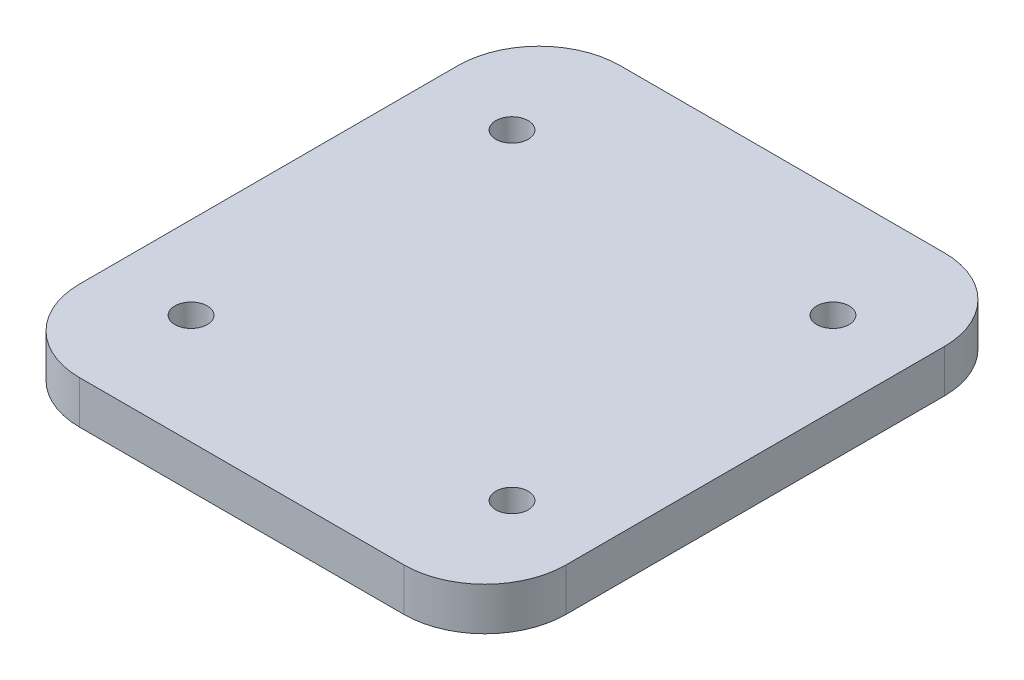
ISO-10303-21;
HEADER;
FILE_DESCRIPTION(('STEP AP214'),'2;1');
FILE_NAME('part.step','',(''),(''),'','','');
FILE_SCHEMA(('AUTOMOTIVE_DESIGN { 1 0 10303 214 1 1 1 1 }'));
ENDSEC;
DATA;
#1=APPLICATION_CONTEXT('core data for automotive mechanical design processes');
#2=APPLICATION_PROTOCOL_DEFINITION('international standard','automotive_design',2000,#1);
#3=PRODUCT_CONTEXT('',#1,'mechanical');
#4=PRODUCT('Part','Part','',(#3));
#5=PRODUCT_RELATED_PRODUCT_CATEGORY('part','',(#4));
#6=PRODUCT_DEFINITION_FORMATION('','',#4);
#7=PRODUCT_DEFINITION_CONTEXT('part definition',#1,'design');
#8=PRODUCT_DEFINITION('design','',#6,#7);
#9=PRODUCT_DEFINITION_SHAPE('','',#8);
#10=(LENGTH_UNIT() NAMED_UNIT(*) SI_UNIT(.MILLI.,.METRE.));
#11=(NAMED_UNIT(*) PLANE_ANGLE_UNIT() SI_UNIT($,.RADIAN.));
#12=(NAMED_UNIT(*) SI_UNIT($,.STERADIAN.) SOLID_ANGLE_UNIT());
#13=UNCERTAINTY_MEASURE_WITH_UNIT(LENGTH_MEASURE(1.E-05),#10,'distance_accuracy_value','');
#14=(GEOMETRIC_REPRESENTATION_CONTEXT(3) GLOBAL_UNCERTAINTY_ASSIGNED_CONTEXT((#13)) GLOBAL_UNIT_ASSIGNED_CONTEXT((#10,
#11,#12)) REPRESENTATION_CONTEXT('',''));
#15=CARTESIAN_POINT('',(0.,0.,0.));
#16=DIRECTION('',(0.,0.,1.));
#17=DIRECTION('',(1.,0.,0.));
#18=AXIS2_PLACEMENT_3D('',#15,#16,#17);
#19=CARTESIAN_POINT('',(24.,6.35,-28.));
#20=DIRECTION('',(0.,-1.,0.));
#21=DIRECTION('',(0.,0.,-1.));
#22=AXIS2_PLACEMENT_3D('',#19,#20,#21);
#23=CYLINDRICAL_SURFACE('',#22,12.);
#24=CARTESIAN_POINT('',(24.,0.,-28.));
#25=DIRECTION('',(0.,1.,0.));
#26=DIRECTION('',(0.,0.,-1.));
#27=AXIS2_PLACEMENT_3D('',#24,#25,#26);
#28=CIRCLE('',#27,12.);
#29=CARTESIAN_POINT('',(36.,0.,-28.));
#30=VERTEX_POINT('',#29);
#31=CARTESIAN_POINT('',(24.,0.,-40.));
#32=VERTEX_POINT('',#31);
#33=EDGE_CURVE('E155',#30,#32,#28,.T.);
#34=ORIENTED_EDGE('',*,*,#33,.T.);
#35=DIRECTION('',(0.,-1.,0.));
#36=VECTOR('',#35,1.);
#37=CARTESIAN_POINT('',(24.,6.35,-40.));
#38=LINE('',#37,#36);
#39=CARTESIAN_POINT('',(24.,6.35,-40.));
#40=VERTEX_POINT('',#39);
#41=EDGE_CURVE('E11',#40,#32,#38,.T.);
#42=ORIENTED_EDGE('',*,*,#41,.F.);
#43=CARTESIAN_POINT('',(24.,6.35,-28.));
#44=DIRECTION('',(0.,1.,0.));
#45=DIRECTION('',(0.,0.,-1.));
#46=AXIS2_PLACEMENT_3D('',#43,#44,#45);
#47=CIRCLE('',#46,12.);
#48=CARTESIAN_POINT('',(36.,6.35,-28.));
#49=VERTEX_POINT('',#48);
#50=EDGE_CURVE('E171',#49,#40,#47,.T.);
#51=ORIENTED_EDGE('',*,*,#50,.F.);
#52=DIRECTION('',(0.,-1.,0.));
#53=VECTOR('',#52,1.);
#54=CARTESIAN_POINT('',(36.,6.35,-28.));
#55=LINE('',#54,#53);
#56=EDGE_CURVE('E134',#49,#30,#55,.T.);
#57=ORIENTED_EDGE('',*,*,#56,.T.);
#58=EDGE_LOOP('',(#34,#42,#51,#57));
#59=FACE_BOUND('',#58,.T.);
#60=ADVANCED_FACE('F39',(#59),#23,.T.);
#61=CARTESIAN_POINT('',(-24.,6.35,-40.));
#62=DIRECTION('',(0.,0.,1.));
#63=DIRECTION('',(1.,0.,0.));
#64=AXIS2_PLACEMENT_3D('',#61,#62,#63);
#65=PLANE('',#64);
#66=DIRECTION('',(-1.,0.,0.));
#67=VECTOR('',#66,1.);
#68=CARTESIAN_POINT('',(-24.,0.,-40.));
#69=LINE('',#68,#67);
#70=CARTESIAN_POINT('',(-24.,0.,-40.));
#71=VERTEX_POINT('',#70);
#72=EDGE_CURVE('E151',#32,#71,#69,.T.);
#73=ORIENTED_EDGE('',*,*,#72,.T.);
#74=DIRECTION('',(0.,-1.,0.));
#75=VECTOR('',#74,1.);
#76=CARTESIAN_POINT('',(-24.,6.35,-40.));
#77=LINE('',#76,#75);
#78=CARTESIAN_POINT('',(-24.,6.35,-40.));
#79=VERTEX_POINT('',#78);
#80=EDGE_CURVE('E47',#79,#71,#77,.T.);
#81=ORIENTED_EDGE('',*,*,#80,.F.);
#82=DIRECTION('',(-1.,0.,0.));
#83=VECTOR('',#82,1.);
#84=CARTESIAN_POINT('',(-24.,6.35,-40.));
#85=LINE('',#84,#83);
#86=EDGE_CURVE('E94',#40,#79,#85,.T.);
#87=ORIENTED_EDGE('',*,*,#86,.F.);
#88=ORIENTED_EDGE('',*,*,#41,.T.);
#89=EDGE_LOOP('',(#73,#81,#87,#88));
#90=FACE_BOUND('',#89,.T.);
#91=ADVANCED_FACE('F152',(#90),#65,.F.);
#92=CARTESIAN_POINT('',(-24.,6.35,-28.));
#93=DIRECTION('',(0.,-1.,0.));
#94=DIRECTION('',(0.,0.,-1.));
#95=AXIS2_PLACEMENT_3D('',#92,#93,#94);
#96=CYLINDRICAL_SURFACE('',#95,12.);
#97=CARTESIAN_POINT('',(-24.,0.,-28.));
#98=DIRECTION('',(0.,1.,0.));
#99=DIRECTION('',(0.,0.,-1.));
#100=AXIS2_PLACEMENT_3D('',#97,#98,#99);
#101=CIRCLE('',#100,12.);
#102=CARTESIAN_POINT('',(-36.,0.,-28.));
#103=VERTEX_POINT('',#102);
#104=EDGE_CURVE('E148',#71,#103,#101,.T.);
#105=ORIENTED_EDGE('',*,*,#104,.T.);
#106=DIRECTION('',(0.,-1.,0.));
#107=VECTOR('',#106,1.);
#108=CARTESIAN_POINT('',(-36.,6.35,-28.));
#109=LINE('',#108,#107);
#110=CARTESIAN_POINT('',(-36.,6.35,-28.));
#111=VERTEX_POINT('',#110);
#112=EDGE_CURVE('E140',#111,#103,#109,.T.);
#113=ORIENTED_EDGE('',*,*,#112,.F.);
#114=CARTESIAN_POINT('',(-24.,6.35,-28.));
#115=DIRECTION('',(0.,1.,0.));
#116=DIRECTION('',(0.,0.,-1.));
#117=AXIS2_PLACEMENT_3D('',#114,#115,#116);
#118=CIRCLE('',#117,12.);
#119=EDGE_CURVE('E150',#79,#111,#118,.T.);
#120=ORIENTED_EDGE('',*,*,#119,.F.);
#121=ORIENTED_EDGE('',*,*,#80,.T.);
#122=EDGE_LOOP('',(#105,#113,#120,#121));
#123=FACE_BOUND('',#122,.T.);
#124=ADVANCED_FACE('F146',(#123),#96,.T.);
#125=CARTESIAN_POINT('',(-36.,6.35,28.));
#126=DIRECTION('',(1.,0.,0.));
#127=DIRECTION('',(0.,0.,-1.));
#128=AXIS2_PLACEMENT_3D('',#125,#126,#127);
#129=PLANE('',#128);
#130=DIRECTION('',(0.,0.,1.));
#131=VECTOR('',#130,1.);
#132=CARTESIAN_POINT('',(-36.,0.,28.));
#133=LINE('',#132,#131);
#134=CARTESIAN_POINT('',(-36.,0.,28.));
#135=VERTEX_POINT('',#134);
#136=EDGE_CURVE('E157',#103,#135,#133,.T.);
#137=ORIENTED_EDGE('',*,*,#136,.T.);
#138=DIRECTION('',(0.,-1.,0.));
#139=VECTOR('',#138,1.);
#140=CARTESIAN_POINT('',(-36.,6.35,28.));
#141=LINE('',#140,#139);
#142=CARTESIAN_POINT('',(-36.,6.35,28.));
#143=VERTEX_POINT('',#142);
#144=EDGE_CURVE('E132',#143,#135,#141,.T.);
#145=ORIENTED_EDGE('',*,*,#144,.F.);
#146=DIRECTION('',(0.,0.,1.));
#147=VECTOR('',#146,1.);
#148=CARTESIAN_POINT('',(-36.,6.35,28.));
#149=LINE('',#148,#147);
#150=EDGE_CURVE('E176',#111,#143,#149,.T.);
#151=ORIENTED_EDGE('',*,*,#150,.F.);
#152=ORIENTED_EDGE('',*,*,#112,.T.);
#153=EDGE_LOOP('',(#137,#145,#151,#152));
#154=FACE_BOUND('',#153,.T.);
#155=ADVANCED_FACE('F248',(#154),#129,.F.);
#156=CARTESIAN_POINT('',(-24.,6.35,28.));
#157=DIRECTION('',(0.,-1.,0.));
#158=DIRECTION('',(0.,0.,-1.));
#159=AXIS2_PLACEMENT_3D('',#156,#157,#158);
#160=CYLINDRICAL_SURFACE('',#159,12.);
#161=CARTESIAN_POINT('',(-24.,0.,28.));
#162=DIRECTION('',(0.,1.,0.));
#163=DIRECTION('',(0.,0.,-1.));
#164=AXIS2_PLACEMENT_3D('',#161,#162,#163);
#165=CIRCLE('',#164,12.);
#166=CARTESIAN_POINT('',(-24.,0.,40.));
#167=VERTEX_POINT('',#166);
#168=EDGE_CURVE('E165',#135,#167,#165,.T.);
#169=ORIENTED_EDGE('',*,*,#168,.T.);
#170=DIRECTION('',(0.,-1.,0.));
#171=VECTOR('',#170,1.);
#172=CARTESIAN_POINT('',(-24.,6.35,40.));
#173=LINE('',#172,#171);
#174=CARTESIAN_POINT('',(-24.,6.35,40.));
#175=VERTEX_POINT('',#174);
#176=EDGE_CURVE('E130',#175,#167,#173,.T.);
#177=ORIENTED_EDGE('',*,*,#176,.F.);
#178=CARTESIAN_POINT('',(-24.,6.35,28.));
#179=DIRECTION('',(0.,1.,0.));
#180=DIRECTION('',(0.,0.,-1.));
#181=AXIS2_PLACEMENT_3D('',#178,#179,#180);
#182=CIRCLE('',#181,12.);
#183=EDGE_CURVE('E123',#143,#175,#182,.T.);
#184=ORIENTED_EDGE('',*,*,#183,.F.);
#185=ORIENTED_EDGE('',*,*,#144,.T.);
#186=EDGE_LOOP('',(#169,#177,#184,#185));
#187=FACE_BOUND('',#186,.T.);
#188=ADVANCED_FACE('F250',(#187),#160,.T.);
#189=CARTESIAN_POINT('',(-24.,6.35,40.));
#190=DIRECTION('',(0.,0.,-1.));
#191=DIRECTION('',(-1.,0.,0.));
#192=AXIS2_PLACEMENT_3D('',#189,#190,#191);
#193=PLANE('',#192);
#194=DIRECTION('',(1.,0.,0.));
#195=VECTOR('',#194,1.);
#196=CARTESIAN_POINT('',(-24.,0.,40.));
#197=LINE('',#196,#195);
#198=CARTESIAN_POINT('',(24.,0.,40.));
#199=VERTEX_POINT('',#198);
#200=EDGE_CURVE('E129',#167,#199,#197,.T.);
#201=ORIENTED_EDGE('',*,*,#200,.T.);
#202=DIRECTION('',(0.,-1.,0.));
#203=VECTOR('',#202,1.);
#204=CARTESIAN_POINT('',(24.,6.35,40.));
#205=LINE('',#204,#203);
#206=CARTESIAN_POINT('',(24.,6.35,40.));
#207=VERTEX_POINT('',#206);
#208=EDGE_CURVE('E115',#207,#199,#205,.T.);
#209=ORIENTED_EDGE('',*,*,#208,.F.);
#210=DIRECTION('',(1.,0.,0.));
#211=VECTOR('',#210,1.);
#212=CARTESIAN_POINT('',(-24.,6.35,40.));
#213=LINE('',#212,#211);
#214=EDGE_CURVE('E118',#175,#207,#213,.T.);
#215=ORIENTED_EDGE('',*,*,#214,.F.);
#216=ORIENTED_EDGE('',*,*,#176,.T.);
#217=EDGE_LOOP('',(#201,#209,#215,#216));
#218=FACE_BOUND('',#217,.T.);
#219=ADVANCED_FACE('F128',(#218),#193,.F.);
#220=CARTESIAN_POINT('',(24.,6.35,28.));
#221=DIRECTION('',(0.,-1.,0.));
#222=DIRECTION('',(0.,0.,-1.));
#223=AXIS2_PLACEMENT_3D('',#220,#221,#222);
#224=CYLINDRICAL_SURFACE('',#223,12.);
#225=CARTESIAN_POINT('',(24.,0.,28.));
#226=DIRECTION('',(0.,1.,0.));
#227=DIRECTION('',(0.,0.,1.));
#228=AXIS2_PLACEMENT_3D('',#225,#226,#227);
#229=CIRCLE('',#228,12.);
#230=CARTESIAN_POINT('',(36.,0.,28.));
#231=VERTEX_POINT('',#230);
#232=EDGE_CURVE('E169',#199,#231,#229,.T.);
#233=ORIENTED_EDGE('',*,*,#232,.T.);
#234=DIRECTION('',(0.,-1.,0.));
#235=VECTOR('',#234,1.);
#236=CARTESIAN_POINT('',(36.,6.35,28.));
#237=LINE('',#236,#235);
#238=CARTESIAN_POINT('',(36.,6.35,28.));
#239=VERTEX_POINT('',#238);
#240=EDGE_CURVE('E117',#239,#231,#237,.T.);
#241=ORIENTED_EDGE('',*,*,#240,.F.);
#242=CARTESIAN_POINT('',(24.,6.35,28.));
#243=DIRECTION('',(0.,1.,0.));
#244=DIRECTION('',(0.,0.,1.));
#245=AXIS2_PLACEMENT_3D('',#242,#243,#244);
#246=CIRCLE('',#245,12.);
#247=EDGE_CURVE('E110',#207,#239,#246,.T.);
#248=ORIENTED_EDGE('',*,*,#247,.F.);
#249=ORIENTED_EDGE('',*,*,#208,.T.);
#250=EDGE_LOOP('',(#233,#241,#248,#249));
#251=FACE_BOUND('',#250,.T.);
#252=ADVANCED_FACE('F113',(#251),#224,.T.);
#253=CARTESIAN_POINT('',(36.,6.35,28.));
#254=DIRECTION('',(-1.,0.,0.));
#255=DIRECTION('',(0.,0.,1.));
#256=AXIS2_PLACEMENT_3D('',#253,#254,#255);
#257=PLANE('',#256);
#258=DIRECTION('',(0.,0.,-1.));
#259=VECTOR('',#258,1.);
#260=CARTESIAN_POINT('',(36.,0.,28.));
#261=LINE('',#260,#259);
#262=EDGE_CURVE('E83',#231,#30,#261,.T.);
#263=ORIENTED_EDGE('',*,*,#262,.T.);
#264=ORIENTED_EDGE('',*,*,#56,.F.);
#265=DIRECTION('',(0.,0.,-1.));
#266=VECTOR('',#265,1.);
#267=CARTESIAN_POINT('',(36.,6.35,28.));
#268=LINE('',#267,#266);
#269=EDGE_CURVE('E55',#239,#49,#268,.T.);
#270=ORIENTED_EDGE('',*,*,#269,.F.);
#271=ORIENTED_EDGE('',*,*,#240,.T.);
#272=EDGE_LOOP('',(#263,#264,#270,#271));
#273=FACE_BOUND('',#272,.T.);
#274=ADVANCED_FACE('F227',(#273),#257,.F.);
#275=CARTESIAN_POINT('',(24.,6.35,-28.));
#276=DIRECTION('',(0.,-1.,0.));
#277=DIRECTION('',(0.,0.,-1.));
#278=AXIS2_PLACEMENT_3D('',#275,#276,#277);
#279=PLANE('',#278);
#280=CARTESIAN_POINT('',(-23.75,6.35,-23.75));
#281=DIRECTION('',(0.,1.,0.));
#282=DIRECTION('',(0.,0.,1.));
#283=AXIS2_PLACEMENT_3D('',#280,#281,#282);
#284=CIRCLE('',#283,2.4);
#285=CARTESIAN_POINT('',(-23.75,6.35,-21.35));
#286=VERTEX_POINT('',#285);
#287=EDGE_CURVE('E198',#286,#286,#284,.T.);
#288=ORIENTED_EDGE('',*,*,#287,.F.);
#289=EDGE_LOOP('',(#288));
#290=FACE_BOUND('',#289,.T.);
#291=CARTESIAN_POINT('',(23.75,6.35,23.75));
#292=DIRECTION('',(0.,1.,0.));
#293=DIRECTION('',(0.,0.,1.));
#294=AXIS2_PLACEMENT_3D('',#291,#292,#293);
#295=CIRCLE('',#294,2.4);
#296=CARTESIAN_POINT('',(23.75,6.35,26.15));
#297=VERTEX_POINT('',#296);
#298=EDGE_CURVE('E189',#297,#297,#295,.T.);
#299=ORIENTED_EDGE('',*,*,#298,.F.);
#300=EDGE_LOOP('',(#299));
#301=FACE_BOUND('',#300,.T.);
#302=CARTESIAN_POINT('',(-23.75,6.35,23.75));
#303=DIRECTION('',(0.,1.,0.));
#304=DIRECTION('',(0.,0.,1.));
#305=AXIS2_PLACEMENT_3D('',#302,#303,#304);
#306=CIRCLE('',#305,2.4);
#307=CARTESIAN_POINT('',(-23.75,6.35,26.15));
#308=VERTEX_POINT('',#307);
#309=EDGE_CURVE('E205',#308,#308,#306,.T.);
#310=ORIENTED_EDGE('',*,*,#309,.F.);
#311=EDGE_LOOP('',(#310));
#312=FACE_BOUND('',#311,.T.);
#313=CARTESIAN_POINT('',(23.75,6.35,-23.75));
#314=DIRECTION('',(0.,1.,0.));
#315=DIRECTION('',(0.,0.,1.));
#316=AXIS2_PLACEMENT_3D('',#313,#314,#315);
#317=CIRCLE('',#316,2.4);
#318=CARTESIAN_POINT('',(23.75,6.35,-21.35));
#319=VERTEX_POINT('',#318);
#320=EDGE_CURVE('E181',#319,#319,#317,.T.);
#321=ORIENTED_EDGE('',*,*,#320,.F.);
#322=EDGE_LOOP('',(#321));
#323=FACE_BOUND('',#322,.T.);
#324=ORIENTED_EDGE('',*,*,#50,.T.);
#325=ORIENTED_EDGE('',*,*,#86,.T.);
#326=ORIENTED_EDGE('',*,*,#119,.T.);
#327=ORIENTED_EDGE('',*,*,#150,.T.);
#328=ORIENTED_EDGE('',*,*,#183,.T.);
#329=ORIENTED_EDGE('',*,*,#214,.T.);
#330=ORIENTED_EDGE('',*,*,#247,.T.);
#331=ORIENTED_EDGE('',*,*,#269,.T.);
#332=EDGE_LOOP('',(#324,#325,#326,#327,#328,#329,#330,#331));
#333=FACE_BOUND('',#332,.T.);
#334=ADVANCED_FACE('F121',(#290,#301,#312,#323,#333),#279,.F.);
#335=CARTESIAN_POINT('',(24.,0.,-28.));
#336=DIRECTION('',(0.,-1.,0.));
#337=DIRECTION('',(0.,0.,-1.));
#338=AXIS2_PLACEMENT_3D('',#335,#336,#337);
#339=PLANE('',#338);
#340=CARTESIAN_POINT('',(-23.75,0.,-23.75));
#341=DIRECTION('',(0.,1.,0.));
#342=DIRECTION('',(0.,0.,1.));
#343=AXIS2_PLACEMENT_3D('',#340,#341,#342);
#344=CIRCLE('',#343,2.4);
#345=CARTESIAN_POINT('',(-23.75,0.,-21.35));
#346=VERTEX_POINT('',#345);
#347=EDGE_CURVE('E185',#346,#346,#344,.T.);
#348=ORIENTED_EDGE('',*,*,#347,.T.);
#349=EDGE_LOOP('',(#348));
#350=FACE_BOUND('',#349,.T.);
#351=CARTESIAN_POINT('',(23.75,0.,23.75));
#352=DIRECTION('',(0.,1.,0.));
#353=DIRECTION('',(0.,0.,1.));
#354=AXIS2_PLACEMENT_3D('',#351,#352,#353);
#355=CIRCLE('',#354,2.4);
#356=CARTESIAN_POINT('',(23.75,0.,26.15));
#357=VERTEX_POINT('',#356);
#358=EDGE_CURVE('E193',#357,#357,#355,.T.);
#359=ORIENTED_EDGE('',*,*,#358,.T.);
#360=EDGE_LOOP('',(#359));
#361=FACE_BOUND('',#360,.T.);
#362=CARTESIAN_POINT('',(-23.75,0.,23.75));
#363=DIRECTION('',(0.,1.,0.));
#364=DIRECTION('',(0.,0.,1.));
#365=AXIS2_PLACEMENT_3D('',#362,#363,#364);
#366=CIRCLE('',#365,2.4);
#367=CARTESIAN_POINT('',(-23.75,0.,26.15));
#368=VERTEX_POINT('',#367);
#369=EDGE_CURVE('E194',#368,#368,#366,.T.);
#370=ORIENTED_EDGE('',*,*,#369,.T.);
#371=EDGE_LOOP('',(#370));
#372=FACE_BOUND('',#371,.T.);
#373=CARTESIAN_POINT('',(23.75,0.,-23.75));
#374=DIRECTION('',(0.,1.,0.));
#375=DIRECTION('',(0.,0.,1.));
#376=AXIS2_PLACEMENT_3D('',#373,#374,#375);
#377=CIRCLE('',#376,2.4);
#378=CARTESIAN_POINT('',(23.75,0.,-21.35));
#379=VERTEX_POINT('',#378);
#380=EDGE_CURVE('E159',#379,#379,#377,.T.);
#381=ORIENTED_EDGE('',*,*,#380,.T.);
#382=EDGE_LOOP('',(#381));
#383=FACE_BOUND('',#382,.T.);
#384=ORIENTED_EDGE('',*,*,#33,.F.);
#385=ORIENTED_EDGE('',*,*,#262,.F.);
#386=ORIENTED_EDGE('',*,*,#232,.F.);
#387=ORIENTED_EDGE('',*,*,#200,.F.);
#388=ORIENTED_EDGE('',*,*,#168,.F.);
#389=ORIENTED_EDGE('',*,*,#136,.F.);
#390=ORIENTED_EDGE('',*,*,#104,.F.);
#391=ORIENTED_EDGE('',*,*,#72,.F.);
#392=EDGE_LOOP('',(#384,#385,#386,#387,#388,#389,#390,#391));
#393=FACE_BOUND('',#392,.T.);
#394=ADVANCED_FACE('F214',(#350,#361,#372,#383,#393),#339,.T.);
#395=CARTESIAN_POINT('',(23.75,0.,-23.75));
#396=DIRECTION('',(0.,1.,0.));
#397=DIRECTION('',(0.,0.,1.));
#398=AXIS2_PLACEMENT_3D('',#395,#396,#397);
#399=CYLINDRICAL_SURFACE('',#398,2.4);
#400=ORIENTED_EDGE('',*,*,#380,.F.);
#401=EDGE_LOOP('',(#400));
#402=FACE_BOUND('',#401,.T.);
#403=ORIENTED_EDGE('',*,*,#320,.T.);
#404=EDGE_LOOP('',(#403));
#405=FACE_BOUND('',#404,.T.);
#406=ADVANCED_FACE('F221',(#402,#405),#399,.F.);
#407=CARTESIAN_POINT('',(-23.75,0.,23.75));
#408=DIRECTION('',(0.,1.,0.));
#409=DIRECTION('',(0.,0.,1.));
#410=AXIS2_PLACEMENT_3D('',#407,#408,#409);
#411=CYLINDRICAL_SURFACE('',#410,2.4);
#412=ORIENTED_EDGE('',*,*,#369,.F.);
#413=EDGE_LOOP('',(#412));
#414=FACE_BOUND('',#413,.T.);
#415=ORIENTED_EDGE('',*,*,#309,.T.);
#416=EDGE_LOOP('',(#415));
#417=FACE_BOUND('',#416,.T.);
#418=ADVANCED_FACE('F217',(#414,#417),#411,.F.);
#419=CARTESIAN_POINT('',(23.75,0.,23.75));
#420=DIRECTION('',(0.,1.,0.));
#421=DIRECTION('',(0.,0.,1.));
#422=AXIS2_PLACEMENT_3D('',#419,#420,#421);
#423=CYLINDRICAL_SURFACE('',#422,2.4);
#424=ORIENTED_EDGE('',*,*,#358,.F.);
#425=EDGE_LOOP('',(#424));
#426=FACE_BOUND('',#425,.T.);
#427=ORIENTED_EDGE('',*,*,#298,.T.);
#428=EDGE_LOOP('',(#427));
#429=FACE_BOUND('',#428,.T.);
#430=ADVANCED_FACE('F220',(#426,#429),#423,.F.);
#431=CARTESIAN_POINT('',(-23.75,0.,-23.75));
#432=DIRECTION('',(0.,1.,0.));
#433=DIRECTION('',(0.,0.,1.));
#434=AXIS2_PLACEMENT_3D('',#431,#432,#433);
#435=CYLINDRICAL_SURFACE('',#434,2.4);
#436=ORIENTED_EDGE('',*,*,#347,.F.);
#437=EDGE_LOOP('',(#436));
#438=FACE_BOUND('',#437,.T.);
#439=ORIENTED_EDGE('',*,*,#287,.T.);
#440=EDGE_LOOP('',(#439));
#441=FACE_BOUND('',#440,.T.);
#442=ADVANCED_FACE('F328',(#438,#441),#435,.F.);
#443=CLOSED_SHELL('',(#60,#91,#124,#155,#188,#219,#252,#274,#334,#394,#406,#418,#430,#442));
#444=MANIFOLD_SOLID_BREP('B2',#443);
#445=ADVANCED_BREP_SHAPE_REPRESENTATION('',(#18,#444),#14);
#446=SHAPE_DEFINITION_REPRESENTATION(#9,#445);
ENDSEC;
END-ISO-10303-21;
